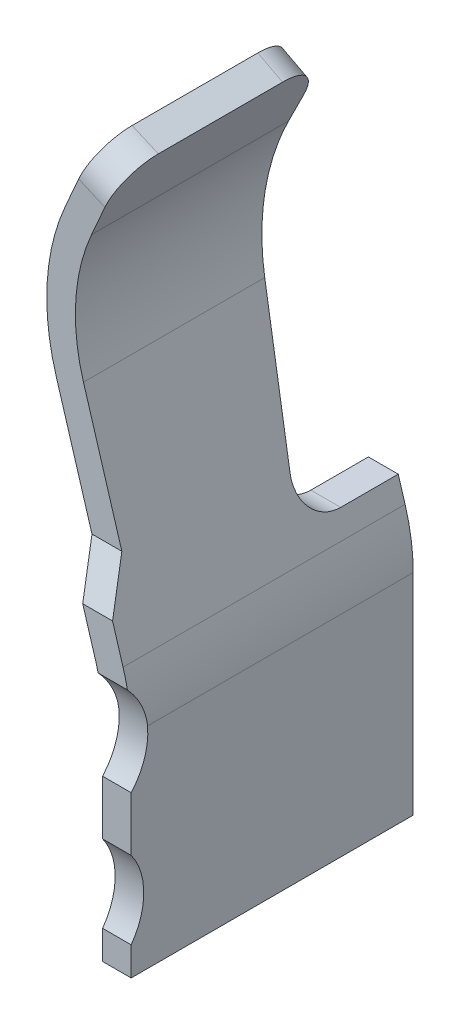
ISO-10303-21;
HEADER;
FILE_DESCRIPTION(('STEP AP214'),'2;1');
FILE_NAME('part.step','',(''),(''),'','','');
FILE_SCHEMA(('AUTOMOTIVE_DESIGN { 1 0 10303 214 1 1 1 1 }'));
ENDSEC;
DATA;
#1=APPLICATION_CONTEXT('core data for automotive mechanical design processes');
#2=APPLICATION_PROTOCOL_DEFINITION('international standard','automotive_design',2000,#1);
#3=PRODUCT_CONTEXT('',#1,'mechanical');
#4=PRODUCT('Part','Part','',(#3));
#5=PRODUCT_RELATED_PRODUCT_CATEGORY('part','',(#4));
#6=PRODUCT_DEFINITION_FORMATION('','',#4);
#7=PRODUCT_DEFINITION_CONTEXT('part definition',#1,'design');
#8=PRODUCT_DEFINITION('design','',#6,#7);
#9=PRODUCT_DEFINITION_SHAPE('','',#8);
#10=(LENGTH_UNIT() NAMED_UNIT(*) SI_UNIT(.MILLI.,.METRE.));
#11=(NAMED_UNIT(*) PLANE_ANGLE_UNIT() SI_UNIT($,.RADIAN.));
#12=(NAMED_UNIT(*) SI_UNIT($,.STERADIAN.) SOLID_ANGLE_UNIT());
#13=UNCERTAINTY_MEASURE_WITH_UNIT(LENGTH_MEASURE(1.E-05),#10,'distance_accuracy_value','');
#14=(GEOMETRIC_REPRESENTATION_CONTEXT(3) GLOBAL_UNCERTAINTY_ASSIGNED_CONTEXT((#13)) GLOBAL_UNIT_ASSIGNED_CONTEXT((#10,
#11,#12)) REPRESENTATION_CONTEXT('',''));
#15=CARTESIAN_POINT('',(0.,0.,0.));
#16=DIRECTION('',(0.,0.,1.));
#17=DIRECTION('',(1.,0.,0.));
#18=AXIS2_PLACEMENT_3D('',#15,#16,#17);
#19=CARTESIAN_POINT('',(9.49844493318108,3.52330708865174,0.423604352914839));
#20=DIRECTION('',(0.915327071470026,-0.402711251685505,0.));
#21=DIRECTION('',(0.402711251685505,0.915327071470026,0.));
#22=AXIS2_PLACEMENT_3D('',#19,#20,#21);
#23=CYLINDRICAL_SURFACE('',#22,0.2);
#24=CARTESIAN_POINT('',(9.49844493318108,3.52330708865174,0.423604352914839));
#25=DIRECTION('',(-0.915327071470029,0.402711251685498,0.));
#26=DIRECTION('',(0.402711251685498,0.915327071470029,0.));
#27=AXIS2_PLACEMENT_3D('',#24,#25,#26);
#28=CIRCLE('',#27,0.2);
#29=CARTESIAN_POINT('',(9.49844493318108,3.52330708865174,0.623604352914839));
#30=VERTEX_POINT('',#29);
#31=CARTESIAN_POINT('',(9.57898718351818,3.70637250294574,0.423604352914839));
#32=VERTEX_POINT('',#31);
#33=EDGE_CURVE('E308',#30,#32,#28,.T.);
#34=ORIENTED_EDGE('',*,*,#33,.F.);
#35=DIRECTION('',(-0.915327071470027,0.402711251685503,0.));
#36=VECTOR('',#35,1.);
#37=CARTESIAN_POINT('',(-15.1115059297135,14.3508073613119,0.623604352914805));
#38=LINE('',#37,#36);
#39=CARTESIAN_POINT('',(9.63574399390158,3.46290040089891,0.623604352914839));
#40=VERTEX_POINT('',#39);
#41=EDGE_CURVE('E27',#40,#30,#38,.T.);
#42=ORIENTED_EDGE('',*,*,#41,.F.);
#43=CARTESIAN_POINT('',(9.63574399390158,3.46290040089891,0.423604352914839));
#44=DIRECTION('',(0.915327071470029,-0.402711251685498,0.));
#45=DIRECTION('',(-0.402711251685498,-0.915327071470029,0.));
#46=AXIS2_PLACEMENT_3D('',#43,#44,#45);
#47=CIRCLE('',#46,0.2);
#48=CARTESIAN_POINT('',(9.71628624423869,3.64596581519291,0.423604352914839));
#49=VERTEX_POINT('',#48);
#50=EDGE_CURVE('E342',#49,#40,#47,.T.);
#51=ORIENTED_EDGE('',*,*,#50,.F.);
#52=DIRECTION('',(0.915327071470027,-0.402711251685503,0.));
#53=VECTOR('',#52,1.);
#54=CARTESIAN_POINT('',(9.57898718351818,3.70637250294574,0.423604352914839));
#55=LINE('',#54,#53);
#56=EDGE_CURVE('E446',#32,#49,#55,.T.);
#57=ORIENTED_EDGE('',*,*,#56,.F.);
#58=EDGE_LOOP('',(#34,#42,#51,#57));
#59=FACE_BOUND('',#58,.T.);
#60=ADVANCED_FACE('F16',(#59),#23,.T.);
#61=CARTESIAN_POINT('',(9.47613725867001,3.53312166947706,-0.236832722369337));
#62=DIRECTION('',(-0.914255270392897,0.402239697454475,-0.0483789866630451));
#63=DIRECTION('',(-0.402711251685505,-0.915327071470026,0.));
#64=AXIS2_PLACEMENT_3D('',#61,#62,#63);
#65=CYLINDRICAL_SURFACE('',#64,0.2);
#66=CARTESIAN_POINT('',(9.62694053804578,3.44289092405021,-0.427421697659668));
#67=CARTESIAN_POINT('',(9.67801746519237,3.55898426375477,-0.441384710680955));
#68=CARTESIAN_POINT('',(9.71628624423869,3.64596581519291,-0.356133634256614));
#69=CARTESIAN_POINT('',(9.71628624423869,3.64596581519291,-0.228386927890316));
#70=(BOUNDED_CURVE() B_SPLINE_CURVE(3,(#66,#67,#68,#69),.UNSPECIFIED.,.F.,
.F.) B_SPLINE_CURVE_WITH_KNOTS((4,4),(6.17366415670651,7.85398163397443),
.UNSPECIFIED.) CURVE() GEOMETRIC_REPRESENTATION_ITEM() RATIONAL_B_SPLINE_CURVE((1.,
0.778229742533869,0.778229742533869,1.)) REPRESENTATION_ITEM(''));
#71=CARTESIAN_POINT('',(9.62694053804578,3.44289092405021,-0.427421697659668));
#72=VERTEX_POINT('',#71);
#73=CARTESIAN_POINT('',(9.71628624423869,3.64596581519291,-0.228386927890316));
#74=VERTEX_POINT('',#73);
#75=EDGE_CURVE('E338',#72,#74,#70,.T.);
#76=ORIENTED_EDGE('',*,*,#75,.F.);
#77=DIRECTION('',(0.914255270392898,-0.402239697454473,0.0483789866630451));
#78=VECTOR('',#77,1.);
#79=CARTESIAN_POINT('',(-15.711852655037,14.5910558161891,-1.76825633941021));
#80=LINE('',#79,#78);
#81=CARTESIAN_POINT('',(9.48964147732528,3.50329761180303,-0.434687053017796));
#82=VERTEX_POINT('',#81);
#83=EDGE_CURVE('E11',#82,#72,#80,.T.);
#84=ORIENTED_EDGE('',*,*,#83,.F.);
#85=CARTESIAN_POINT('',(9.57898718351818,3.70637250294574,-0.235652283248443));
#86=CARTESIAN_POINT('',(9.57898718351819,3.70637250294574,-0.363398989614741));
#87=CARTESIAN_POINT('',(9.54071840447187,3.6193909515076,-0.448650066039082));
#88=CARTESIAN_POINT('',(9.48964147732528,3.50329761180303,-0.434687053017796));
#89=(BOUNDED_CURVE() B_SPLINE_CURVE(3,(#85,#86,#87,#88),.UNSPECIFIED.,.F.,
.F.) B_SPLINE_CURVE_WITH_KNOTS((4,4),(4.71238898038476,6.39270645765267),
.UNSPECIFIED.) CURVE() GEOMETRIC_REPRESENTATION_ITEM() RATIONAL_B_SPLINE_CURVE((1.,
0.778229742533871,0.778229742533871,1.)) REPRESENTATION_ITEM(''));
#90=CARTESIAN_POINT('',(9.57898718351818,3.70637250294574,-0.235652283248443));
#91=VERTEX_POINT('',#90);
#92=EDGE_CURVE('E381',#91,#82,#89,.T.);
#93=ORIENTED_EDGE('',*,*,#92,.F.);
#94=DIRECTION('',(-0.914255270392898,0.402239697454473,-0.0483789866630451));
#95=VECTOR('',#94,1.);
#96=CARTESIAN_POINT('',(9.55667950900711,3.71618708377106,-0.236832722369337));
#97=LINE('',#96,#95);
#98=EDGE_CURVE('E307',#74,#91,#97,.T.);
#99=ORIENTED_EDGE('',*,*,#98,.F.);
#100=EDGE_LOOP('',(#76,#84,#93,#99));
#101=FACE_BOUND('',#100,.T.);
#102=ADVANCED_FACE('F434',(#101),#65,.T.);
#103=CARTESIAN_POINT('',(-20.57,1.65634067151207,-0.212546111318104));
#104=DIRECTION('',(0.,-1.,0.));
#105=DIRECTION('',(0.,0.,-1.));
#106=AXIS2_PLACEMENT_3D('',#103,#104,#105);
#107=PLANE('',#106);
#108=DIRECTION('',(0.,0.,-1.));
#109=VECTOR('',#108,1.);
#110=CARTESIAN_POINT('',(9.65483507894154,1.65634067151207,-0.740000000000018));
#111=LINE('',#110,#109);
#112=CARTESIAN_POINT('',(9.65483507894154,1.65634067151207,-0.438042305987952));
#113=VERTEX_POINT('',#112);
#114=CARTESIAN_POINT('',(9.65483507894154,1.65634067151207,-0.740000000000018));
#115=VERTEX_POINT('',#114);
#116=EDGE_CURVE('E260',#113,#115,#111,.T.);
#117=ORIENTED_EDGE('',*,*,#116,.F.);
#118=DIRECTION('',(1.,0.,0.));
#119=VECTOR('',#118,1.);
#120=CARTESIAN_POINT('',(9.81150340910556,1.65634067151207,-0.438042305987951));
#121=LINE('',#120,#119);
#122=CARTESIAN_POINT('',(9.81150340910558,1.65634067151207,-0.438042305987951));
#123=VERTEX_POINT('',#122);
#124=EDGE_CURVE('E278',#113,#123,#121,.T.);
#125=ORIENTED_EDGE('',*,*,#124,.T.);
#126=DIRECTION('',(0.,0.,1.));
#127=VECTOR('',#126,1.);
#128=CARTESIAN_POINT('',(9.81150340910558,1.65634067151207,-0.740000000000018));
#129=LINE('',#128,#127);
#130=CARTESIAN_POINT('',(9.81150340910558,1.65634067151207,-0.740000000000018));
#131=VERTEX_POINT('',#130);
#132=EDGE_CURVE('E267',#131,#123,#129,.T.);
#133=ORIENTED_EDGE('',*,*,#132,.F.);
#134=DIRECTION('',(-1.,0.,0.));
#135=VECTOR('',#134,1.);
#136=CARTESIAN_POINT('',(8.89,1.65634067151207,-0.740000000000019));
#137=LINE('',#136,#135);
#138=EDGE_CURVE('E517',#131,#115,#137,.T.);
#139=ORIENTED_EDGE('',*,*,#138,.T.);
#140=EDGE_LOOP('',(#117,#125,#133,#139));
#141=FACE_BOUND('',#140,.T.);
#142=ADVANCED_FACE('F279',(#141),#107,.F.);
#143=CARTESIAN_POINT('',(-20.57,3.70637250294571,-0.459111687165995));
#144=DIRECTION('',(0.,0.119413416546905,0.992844618230162));
#145=DIRECTION('',(1.,0.,0.));
#146=AXIS2_PLACEMENT_3D('',#143,#144,#145);
#147=PLANE('',#146);
#148=DIRECTION('',(-0.28674853992682,0.951150986717314,-0.11439875574724));
#149=VECTOR('',#148,1.);
#150=CARTESIAN_POINT('',(9.8296639548885,1.59610175610151,-0.205300934614502));
#151=LINE('',#150,#149);
#152=CARTESIAN_POINT('',(9.74400830743363,1.88022335482146,-0.239473382341919));
#153=VERTEX_POINT('',#152);
#154=CARTESIAN_POINT('',(9.52341373590366,2.61194022573825,-0.327479914176621));
#155=VERTEX_POINT('',#154);
#156=EDGE_CURVE('E178',#153,#155,#151,.T.);
#157=ORIENTED_EDGE('',*,*,#156,.F.);
#158=DIRECTION('',(-1.,0.,0.));
#159=VECTOR('',#158,1.);
#160=CARTESIAN_POINT('',(9.65483507894153,1.88022335482146,-0.23947338234192));
#161=LINE('',#160,#159);
#162=CARTESIAN_POINT('',(9.58733997726959,1.88022335482146,-0.23947338234192));
#163=VERTEX_POINT('',#162);
#164=EDGE_CURVE('E488',#153,#163,#161,.T.);
#165=ORIENTED_EDGE('',*,*,#164,.T.);
#166=DIRECTION('',(0.286748539926818,-0.951150986717315,0.11439875574724));
#167=VECTOR('',#166,1.);
#168=CARTESIAN_POINT('',(9.68587763511194,1.55337185451571,-0.200161637444145));
#169=LINE('',#168,#167);
#170=CARTESIAN_POINT('',(9.37979823954622,2.56864369924933,-0.322272466749579));
#171=VERTEX_POINT('',#170);
#172=EDGE_CURVE('E326',#171,#163,#169,.T.);
#173=ORIENTED_EDGE('',*,*,#172,.F.);
#174=CARTESIAN_POINT('',(9.42822424609609,3.36370167510267,-0.417897288102545));
#175=CARTESIAN_POINT('',(9.31669920509328,3.11021511680704,-0.387409439934768));
#176=CARTESIAN_POINT('',(9.29986260540396,2.83379189253285,-0.354162906673266));
#177=CARTESIAN_POINT('',(9.37979823954622,2.56864369924933,-0.322272466749579));
#178=(BOUNDED_CURVE() B_SPLINE_CURVE(3,(#174,#175,#176,#177),.UNSPECIFIED.,.F.,
.F.) B_SPLINE_CURVE_WITH_KNOTS((4,4),(4.29791199977039,5.00519872138853),
.UNSPECIFIED.) CURVE() GEOMETRIC_REPRESENTATION_ITEM() RATIONAL_B_SPLINE_CURVE((1.,
0.958744787021091,0.958744787021091,1.)) REPRESENTATION_ITEM(''));
#179=CARTESIAN_POINT('',(9.42822424609609,3.36370167510267,-0.417897288102545));
#180=VERTEX_POINT('',#179);
#181=EDGE_CURVE('E472',#180,#171,#178,.T.);
#182=ORIENTED_EDGE('',*,*,#181,.F.);
#183=DIRECTION('',(-0.400292818236851,-0.909830186054405,0.109428936813832));
#184=VECTOR('',#183,1.);
#185=CARTESIAN_POINT('',(9.44233351008822,3.39577078475993,-0.421754368938234));
#186=LINE('',#185,#184);
#187=EDGE_CURVE('E457',#82,#180,#186,.T.);
#188=ORIENTED_EDGE('',*,*,#187,.F.);
#189=ORIENTED_EDGE('',*,*,#83,.T.);
#190=DIRECTION('',(0.400292818236852,0.909830186054405,-0.109428936813832));
#191=VECTOR('',#190,1.);
#192=CARTESIAN_POINT('',(9.57995081965593,3.33608744850051,-0.414576013974332));
#193=LINE('',#192,#191);
#194=CARTESIAN_POINT('',(9.56552330681658,3.30329498734983,-0.410631932744417));
#195=VERTEX_POINT('',#194);
#196=EDGE_CURVE('E343',#195,#72,#193,.T.);
#197=ORIENTED_EDGE('',*,*,#196,.F.);
#198=CARTESIAN_POINT('',(9.52341373590366,2.61194022573825,-0.327479914176621));
#199=CARTESIAN_POINT('',(9.45390448882343,2.84250387207174,-0.355210731501565));
#200=CARTESIAN_POINT('',(9.4685450102924,3.08287189317973,-0.384120760424611));
#201=CARTESIAN_POINT('',(9.56552330681658,3.30329498734983,-0.410631932744417));
#202=(BOUNDED_CURVE() B_SPLINE_CURVE(3,(#198,#199,#200,#201),.UNSPECIFIED.,.F.,
.F.) B_SPLINE_CURVE_WITH_KNOTS((4,4),(1.27798658579106,1.98527330740919),
.UNSPECIFIED.) CURVE() GEOMETRIC_REPRESENTATION_ITEM() RATIONAL_B_SPLINE_CURVE((1.,
0.958744787021091,0.958744787021091,1.)) REPRESENTATION_ITEM(''));
#203=EDGE_CURVE('E358',#155,#195,#202,.T.);
#204=ORIENTED_EDGE('',*,*,#203,.F.);
#205=EDGE_LOOP('',(#157,#165,#173,#182,#188,#189,#197,#204));
#206=FACE_BOUND('',#205,.T.);
#207=ADVANCED_FACE('F594',(#206),#147,.F.);
#208=CARTESIAN_POINT('',(-20.57,1.94413292378283,0.623604352914797));
#209=DIRECTION('',(0.,0.,-1.));
#210=DIRECTION('',(0.,-1.,0.));
#211=AXIS2_PLACEMENT_3D('',#208,#209,#210);
#212=PLANE('',#211);
#213=DIRECTION('',(-0.402711251685501,-0.915327071470028,0.));
#214=VECTOR('',#213,1.);
#215=CARTESIAN_POINT('',(9.56552330681658,3.30329498734984,0.623604352914839));
#216=LINE('',#215,#214);
#217=CARTESIAN_POINT('',(9.56552330681658,3.30329498734984,0.623604352914839));
#218=VERTEX_POINT('',#217);
#219=EDGE_CURVE('E383',#40,#218,#216,.T.);
#220=ORIENTED_EDGE('',*,*,#219,.F.);
#221=ORIENTED_EDGE('',*,*,#41,.T.);
#222=DIRECTION('',(0.4027112516855,0.915327071470028,0.));
#223=VECTOR('',#222,1.);
#224=CARTESIAN_POINT('',(9.42822424609608,3.36370167510267,0.623604352914839));
#225=LINE('',#224,#223);
#226=CARTESIAN_POINT('',(9.42822424609608,3.36370167510267,0.623604352914839));
#227=VERTEX_POINT('',#226);
#228=EDGE_CURVE('E450',#227,#30,#225,.T.);
#229=ORIENTED_EDGE('',*,*,#228,.F.);
#230=CARTESIAN_POINT('',(10.4808503782866,2.90058373566433,0.62360435291484));
#231=DIRECTION('',(0.,0.,-1.));
#232=DIRECTION('',(-1.,0.,0.));
#233=AXIS2_PLACEMENT_3D('',#230,#231,#232);
#234=CIRCLE('',#233,1.15);
#235=CARTESIAN_POINT('',(9.37979823954621,2.56864369924933,0.623604352914839));
#236=VERTEX_POINT('',#235);
#237=EDGE_CURVE('E382',#236,#227,#234,.T.);
#238=ORIENTED_EDGE('',*,*,#237,.F.);
#239=DIRECTION('',(-0.288643509926088,0.957436642382956,0.));
#240=VECTOR('',#239,1.);
#241=CARTESIAN_POINT('',(9.70382114602551,1.49385284836845,0.623604352914839));
#242=LINE('',#241,#240);
#243=CARTESIAN_POINT('',(9.56807282006432,1.94413292378283,0.623604352914839));
#244=VERTEX_POINT('',#243);
#245=EDGE_CURVE('E337',#244,#236,#242,.T.);
#246=ORIENTED_EDGE('',*,*,#245,.F.);
#247=DIRECTION('',(1.,0.,0.));
#248=VECTOR('',#247,1.);
#249=CARTESIAN_POINT('',(-20.57,1.94413292378283,0.623604352914797));
#250=LINE('',#249,#248);
#251=CARTESIAN_POINT('',(9.72474115022836,1.94413292378283,0.623604352914839));
#252=VERTEX_POINT('',#251);
#253=EDGE_CURVE('E520',#244,#252,#250,.T.);
#254=ORIENTED_EDGE('',*,*,#253,.T.);
#255=DIRECTION('',(0.28864350992609,-0.957436642382956,0.));
#256=VECTOR('',#255,1.);
#257=CARTESIAN_POINT('',(9.84743664238296,1.53714937485737,0.623604352914839));
#258=LINE('',#257,#256);
#259=CARTESIAN_POINT('',(9.52341373590366,2.61194022573825,0.623604352914839));
#260=VERTEX_POINT('',#259);
#261=EDGE_CURVE('E480',#260,#252,#258,.T.);
#262=ORIENTED_EDGE('',*,*,#261,.F.);
#263=CARTESIAN_POINT('',(10.4808503782866,2.90058373566433,0.62360435291484));
#264=DIRECTION('',(0.,0.,1.));
#265=DIRECTION('',(-1.,0.,0.));
#266=AXIS2_PLACEMENT_3D('',#263,#264,#265);
#267=CIRCLE('',#266,1.);
#268=EDGE_CURVE('E193',#218,#260,#267,.T.);
#269=ORIENTED_EDGE('',*,*,#268,.F.);
#270=EDGE_LOOP('',(#220,#221,#229,#238,#246,#254,#262,#269));
#271=FACE_BOUND('',#270,.T.);
#272=ADVANCED_FACE('F580',(#271),#212,.F.);
#273=CARTESIAN_POINT('',(-20.57,1.7003498353216,0.749999999999972));
#274=DIRECTION('',(0.,-0.460287319631494,-0.887770005906065));
#275=DIRECTION('',(0.,-0.887770005906065,0.460287319631494));
#276=AXIS2_PLACEMENT_3D('',#273,#274,#275);
#277=PLANE('',#276);
#278=DIRECTION('',(-1.,0.,0.));
#279=VECTOR('',#278,1.);
#280=CARTESIAN_POINT('',(8.89,1.7196371362757,0.739999999999981));
#281=LINE('',#280,#279);
#282=CARTESIAN_POINT('',(9.79242108767926,1.7196371362757,0.739999999999982));
#283=VERTEX_POINT('',#282);
#284=CARTESIAN_POINT('',(9.63575275751522,1.7196371362757,0.739999999999982));
#285=VERTEX_POINT('',#284);
#286=EDGE_CURVE('E299',#283,#285,#281,.T.);
#287=ORIENTED_EDGE('',*,*,#286,.F.);
#288=DIRECTION('',(0.258541028225372,-0.857586072334425,0.444637678635293));
#289=VECTOR('',#288,1.);
#290=CARTESIAN_POINT('',(9.66642343830643,2.13757401070795,0.523309818502748));
#291=LINE('',#290,#289);
#292=EDGE_CURVE('E484',#252,#283,#291,.T.);
#293=ORIENTED_EDGE('',*,*,#292,.F.);
#294=ORIENTED_EDGE('',*,*,#253,.F.);
#295=DIRECTION('',(-0.258541028225371,0.857586072334425,-0.444637678635293));
#296=VECTOR('',#295,1.);
#297=CARTESIAN_POINT('',(9.5202273619162,2.10283732290249,0.541319952677684));
#298=LINE('',#297,#296);
#299=EDGE_CURVE('E317',#285,#244,#298,.T.);
#300=ORIENTED_EDGE('',*,*,#299,.F.);
#301=EDGE_LOOP('',(#287,#293,#294,#300));
#302=FACE_BOUND('',#301,.T.);
#303=ADVANCED_FACE('F422',(#302),#277,.F.);
#304=CARTESIAN_POINT('',(8.89,1.24850586493128,0.739999999999981));
#305=DIRECTION('',(0.,0.,-1.));
#306=DIRECTION('',(0.,-1.,0.));
#307=AXIS2_PLACEMENT_3D('',#304,#305,#306);
#308=PLANE('',#307);
#309=DIRECTION('',(0.,-1.,0.));
#310=VECTOR('',#309,1.);
#311=CARTESIAN_POINT('',(9.89,0.145965815192914,0.739999999999982));
#312=LINE('',#311,#310);
#313=CARTESIAN_POINT('',(9.89,0.296740599868486,0.739999999999982));
#314=VERTEX_POINT('',#313);
#315=CARTESIAN_POINT('',(9.89,0.145965815192914,0.739999999999982));
#316=VERTEX_POINT('',#315);
#317=EDGE_CURVE('E503',#314,#316,#312,.T.);
#318=ORIENTED_EDGE('',*,*,#317,.F.);
#319=DIRECTION('',(-1.,0.,0.));
#320=VECTOR('',#319,1.);
#321=CARTESIAN_POINT('',(-20.57,0.296740599868486,0.73999999999994));
#322=LINE('',#321,#320);
#323=CARTESIAN_POINT('',(9.74,0.296740599868486,0.739999999999982));
#324=VERTEX_POINT('',#323);
#325=EDGE_CURVE('E529',#314,#324,#322,.T.);
#326=ORIENTED_EDGE('',*,*,#325,.T.);
#327=DIRECTION('',(0.,1.,0.));
#328=VECTOR('',#327,1.);
#329=CARTESIAN_POINT('',(9.74,0.145965815192914,0.739999999999982));
#330=LINE('',#329,#328);
#331=CARTESIAN_POINT('',(9.74,0.145965815192914,0.739999999999982));
#332=VERTEX_POINT('',#331);
#333=EDGE_CURVE('E117',#332,#324,#330,.T.);
#334=ORIENTED_EDGE('',*,*,#333,.F.);
#335=DIRECTION('',(-1.,0.,0.));
#336=VECTOR('',#335,1.);
#337=CARTESIAN_POINT('',(9.74,0.145965815192914,0.739999999999982));
#338=LINE('',#337,#336);
#339=EDGE_CURVE('E395',#316,#332,#338,.T.);
#340=ORIENTED_EDGE('',*,*,#339,.F.);
#341=EDGE_LOOP('',(#318,#326,#334,#340));
#342=FACE_BOUND('',#341,.T.);
#343=ADVANCED_FACE('F552',(#342),#308,.F.);
#344=CARTESIAN_POINT('',(8.89,1.24850586493128,-0.740000000000019));
#345=DIRECTION('',(0.,0.,-1.));
#346=DIRECTION('',(0.,-1.,0.));
#347=AXIS2_PLACEMENT_3D('',#344,#345,#346);
#348=PLANE('',#347);
#349=ORIENTED_EDGE('',*,*,#138,.F.);
#350=DIRECTION('',(0.28864350992609,-0.957436642382956,0.));
#351=VECTOR('',#350,1.);
#352=CARTESIAN_POINT('',(9.84743664238296,1.53714937485737,-0.740000000000018));
#353=LINE('',#352,#351);
#354=CARTESIAN_POINT('',(9.84743664238296,1.53714937485737,-0.740000000000018));
#355=VERTEX_POINT('',#354);
#356=EDGE_CURVE('E274',#131,#355,#353,.T.);
#357=ORIENTED_EDGE('',*,*,#356,.T.);
#358=CARTESIAN_POINT('',(8.89,1.24850586493128,-0.740000000000019));
#359=DIRECTION('',(0.,0.,-1.));
#360=DIRECTION('',(-1.,0.,0.));
#361=AXIS2_PLACEMENT_3D('',#358,#359,#360);
#362=CIRCLE('',#361,1.);
#363=CARTESIAN_POINT('',(9.89,1.24850586493128,-0.740000000000018));
#364=VERTEX_POINT('',#363);
#365=EDGE_CURVE('E500',#355,#364,#362,.T.);
#366=ORIENTED_EDGE('',*,*,#365,.T.);
#367=DIRECTION('',(0.,-1.,0.));
#368=VECTOR('',#367,1.);
#369=CARTESIAN_POINT('',(9.89,0.145965815192914,-0.740000000000018));
#370=LINE('',#369,#368);
#371=CARTESIAN_POINT('',(9.89,0.145965815192914,-0.740000000000018));
#372=VERTEX_POINT('',#371);
#373=EDGE_CURVE('E42',#364,#372,#370,.T.);
#374=ORIENTED_EDGE('',*,*,#373,.T.);
#375=DIRECTION('',(-1.,0.,0.));
#376=VECTOR('',#375,1.);
#377=CARTESIAN_POINT('',(9.74,0.145965815192914,-0.740000000000018));
#378=LINE('',#377,#376);
#379=CARTESIAN_POINT('',(9.74,0.145965815192914,-0.740000000000018));
#380=VERTEX_POINT('',#379);
#381=EDGE_CURVE('E372',#372,#380,#378,.T.);
#382=ORIENTED_EDGE('',*,*,#381,.T.);
#383=DIRECTION('',(0.,1.,0.));
#384=VECTOR('',#383,1.);
#385=CARTESIAN_POINT('',(9.74,0.145965815192914,-0.740000000000018));
#386=LINE('',#385,#384);
#387=CARTESIAN_POINT('',(9.74,1.24850586493128,-0.740000000000018));
#388=VERTEX_POINT('',#387);
#389=EDGE_CURVE('E467',#380,#388,#386,.T.);
#390=ORIENTED_EDGE('',*,*,#389,.T.);
#391=CARTESIAN_POINT('',(8.89,1.24850586493128,-0.740000000000019));
#392=DIRECTION('',(0.,0.,1.));
#393=DIRECTION('',(-1.,0.,0.));
#394=AXIS2_PLACEMENT_3D('',#391,#392,#393);
#395=CIRCLE('',#394,0.85);
#396=CARTESIAN_POINT('',(9.70382114602551,1.49385284836845,-0.740000000000018));
#397=VERTEX_POINT('',#396);
#398=EDGE_CURVE('E348',#388,#397,#395,.T.);
#399=ORIENTED_EDGE('',*,*,#398,.T.);
#400=DIRECTION('',(-0.288643509926088,0.957436642382956,0.));
#401=VECTOR('',#400,1.);
#402=CARTESIAN_POINT('',(9.70382114602551,1.49385284836845,-0.740000000000018));
#403=LINE('',#402,#401);
#404=EDGE_CURVE('E314',#397,#115,#403,.T.);
#405=ORIENTED_EDGE('',*,*,#404,.T.);
#406=EDGE_LOOP('',(#349,#357,#366,#374,#382,#390,#399,#405));
#407=FACE_BOUND('',#406,.T.);
#408=ADVANCED_FACE('F428',(#407),#348,.T.);
#409=CARTESIAN_POINT('',(9.89,0.145965815192914,-0.740000000000018));
#410=DIRECTION('',(-1.,0.,0.));
#411=DIRECTION('',(0.,0.,1.));
#412=AXIS2_PLACEMENT_3D('',#409,#410,#411);
#413=PLANE('',#412);
#414=DIRECTION('',(0.,0.,1.));
#415=VECTOR('',#414,1.);
#416=CARTESIAN_POINT('',(9.89,1.24850586493128,-0.740000000000018));
#417=LINE('',#416,#415);
#418=CARTESIAN_POINT('',(9.89,1.24850586493128,0.654029100989327));
#419=VERTEX_POINT('',#418);
#420=EDGE_CURVE('E499',#364,#419,#417,.T.);
#421=ORIENTED_EDGE('',*,*,#420,.T.);
#422=CARTESIAN_POINT('',(9.89,1.21669179396546,0.995153761033099));
#423=DIRECTION('',(1.,0.,0.));
#424=DIRECTION('',(0.,0.,1.));
#425=AXIS2_PLACEMENT_3D('',#422,#423,#424);
#426=CIRCLE('',#425,0.342604974863759);
#427=CARTESIAN_POINT('',(9.89,0.988055123608201,0.739999999999982));
#428=VERTEX_POINT('',#427);
#429=EDGE_CURVE('E478',#428,#419,#426,.T.);
#430=ORIENTED_EDGE('',*,*,#429,.F.);
#431=DIRECTION('',(0.,-1.,0.));
#432=VECTOR('',#431,1.);
#433=CARTESIAN_POINT('',(9.89,0.145965815192914,0.739999999999982));
#434=LINE('',#433,#432);
#435=CARTESIAN_POINT('',(9.89,0.703259400131467,0.739999999999982));
#436=VERTEX_POINT('',#435);
#437=EDGE_CURVE('E390',#428,#436,#434,.T.);
#438=ORIENTED_EDGE('',*,*,#437,.T.);
#439=CARTESIAN_POINT('',(9.89,0.499999999999977,1.01942683457021));
#440=DIRECTION('',(1.,0.,0.));
#441=DIRECTION('',(0.,0.,1.));
#442=AXIS2_PLACEMENT_3D('',#439,#440,#441);
#443=CIRCLE('',#442,0.345533991988848);
#444=EDGE_CURVE('E532',#314,#436,#443,.T.);
#445=ORIENTED_EDGE('',*,*,#444,.F.);
#446=ORIENTED_EDGE('',*,*,#317,.T.);
#447=DIRECTION('',(0.,0.,1.));
#448=VECTOR('',#447,1.);
#449=CARTESIAN_POINT('',(9.89,0.145965815192914,-0.740000000000018));
#450=LINE('',#449,#448);
#451=EDGE_CURVE('E364',#372,#316,#450,.T.);
#452=ORIENTED_EDGE('',*,*,#451,.F.);
#453=ORIENTED_EDGE('',*,*,#373,.F.);
#454=EDGE_LOOP('',(#421,#430,#438,#445,#446,#452,#453));
#455=FACE_BOUND('',#454,.T.);
#456=ADVANCED_FACE('F424',(#455),#413,.F.);
#457=CARTESIAN_POINT('',(8.89,1.24850586493128,-0.740000000000019));
#458=DIRECTION('',(0.,0.,1.));
#459=DIRECTION('',(1.,0.,0.));
#460=AXIS2_PLACEMENT_3D('',#457,#458,#459);
#461=CYLINDRICAL_SURFACE('',#460,1.);
#462=CARTESIAN_POINT('',(8.89,1.24850586493128,0.739999999999981));
#463=DIRECTION('',(0.,0.,-1.));
#464=DIRECTION('',(-1.,0.,0.));
#465=AXIS2_PLACEMENT_3D('',#462,#463,#464);
#466=CIRCLE('',#465,1.);
#467=CARTESIAN_POINT('',(9.84743664238295,1.53714937485737,0.739999999999982));
#468=VERTEX_POINT('',#467);
#469=CARTESIAN_POINT('',(9.87043911813473,1.44532846432271,0.739999999999982));
#470=VERTEX_POINT('',#469);
#471=EDGE_CURVE('E394',#468,#470,#466,.T.);
#472=ORIENTED_EDGE('',*,*,#471,.T.);
#473=CARTESIAN_POINT('',(9.87043911813472,1.44532846432271,0.739999999999982));
#474=CARTESIAN_POINT('',(9.87112131741684,1.44193024717419,0.736954698545516));
#475=CARTESIAN_POINT('',(9.8717972185085,1.43847176034268,0.733975045899713));
#476=CARTESIAN_POINT('',(9.87312855952598,1.43145643098167,0.728168909339949));
#477=CARTESIAN_POINT('',(9.87378408931623,1.42790021102164,0.725341693611874));
#478=CARTESIAN_POINT('',(9.87507168816973,1.42068928784956,0.719840380711192));
#479=CARTESIAN_POINT('',(9.87570383827923,1.4170350195159,0.71716573280554));
#480=CARTESIAN_POINT('',(9.87694157212658,1.40962817005619,0.711969336935339));
#481=CARTESIAN_POINT('',(9.87754721552129,1.4058758436612,0.709447240161798));
#482=CARTESIAN_POINT('',(9.87872877129686,1.39827302810706,0.704555749407337));
#483=CARTESIAN_POINT('',(9.87930470888847,1.39442262647134,0.702186225501929));
#484=CARTESIAN_POINT('',(9.88042361722598,1.38662388081506,0.697599649617342));
#485=CARTESIAN_POINT('',(9.88096656581679,1.38267547342761,0.695382699975815));
#486=CARTESIAN_POINT('',(9.88201619604995,1.37468096295901,0.69110105992819));
#487=CARTESIAN_POINT('',(9.88252279573886,1.37063466501774,0.689036713287309));
#488=CARTESIAN_POINT('',(9.88349635159398,1.36244473872738,0.685059955148913));
#489=CARTESIAN_POINT('',(9.88396315439605,1.3583008060415,0.683148133100318));
#490=CARTESIAN_POINT('',(9.88485385101726,1.3499144264909,0.679475891500462));
#491=CARTESIAN_POINT('',(9.88527749507101,1.3456715635433,0.677716361222172));
#492=CARTESIAN_POINT('',(9.88607352805793,1.33713872195227,0.674376033868785));
#493=CARTESIAN_POINT('',(9.88644618935102,1.33284913740284,0.672794295796538));
#494=CARTESIAN_POINT('',(9.88713863854791,1.32422362544503,0.669809238507263));
#495=CARTESIAN_POINT('',(9.88745863414993,1.31988795555442,0.668405223722634));
#496=CARTESIAN_POINT('',(9.88804414411011,1.31117101253269,0.665775382478372));
#497=CARTESIAN_POINT('',(9.88830979142467,1.30678987892403,0.664549123358656));
#498=CARTESIAN_POINT('',(9.88878499367845,1.29798278695419,0.662274523841787));
#499=CARTESIAN_POINT('',(9.88899459796072,1.29355687160866,0.661226027233393));
#500=CARTESIAN_POINT('',(9.88935611224076,1.28466100981392,0.659306657193421));
#501=CARTESIAN_POINT('',(9.88950798054882,1.28019103392999,0.658435912321225));
#502=CARTESIAN_POINT('',(9.88975239151872,1.2712078703344,0.656871822149796));
#503=CARTESIAN_POINT('',(9.88984479570128,1.26669460642063,0.65617889318397));
#504=CARTESIAN_POINT('',(9.88996875637607,1.25762568522585,0.654969909316693));
#505=CARTESIAN_POINT('',(9.89000007412201,1.25306993125338,0.654454554866673));
#506=CARTESIAN_POINT('',(9.89,1.24850586493128,0.654029100989326));
#507=B_SPLINE_CURVE_WITH_KNOTS('',3,(#473,#474,#475,#476,#477,#478,#479,#480,#481,#482,#483,
#484,#485,#486,#487,#488,#489,#490,#491,#492,#493,#494,#495,#496,#497,#498,#499,#500,#501,#502,
#503,#504,#505,#506),.UNSPECIFIED.,.F.,.F.,(4,2,2,2,2,2,2,2,2,2,2,2,2,2,2,2,4),(0.,
0.0138407212061407,0.0276076629969691,0.0413212735159895,0.0550022400252169,0.0686713979829165,
0.082349636791924,0.096057804322891,0.1098166123811,0.123650992269016,0.137408310969681,
0.151110002599511,0.164777762982779,0.178433449670275,0.192098978145428,0.205796216649482,
0.219546882133365),.UNSPECIFIED.);
#508=EDGE_CURVE('E653',#470,#419,#507,.T.);
#509=ORIENTED_EDGE('',*,*,#508,.T.);
#510=ORIENTED_EDGE('',*,*,#420,.F.);
#511=ORIENTED_EDGE('',*,*,#365,.F.);
#512=DIRECTION('',(0.,0.,1.));
#513=VECTOR('',#512,1.);
#514=CARTESIAN_POINT('',(9.84743664238296,1.53714937485737,-0.740000000000018));
#515=LINE('',#514,#513);
#516=EDGE_CURVE('E495',#355,#468,#515,.T.);
#517=ORIENTED_EDGE('',*,*,#516,.T.);
#518=EDGE_LOOP('',(#472,#509,#510,#511,#517));
#519=FACE_BOUND('',#518,.T.);
#520=ADVANCED_FACE('F427',(#519),#461,.T.);
#521=CARTESIAN_POINT('',(9.84743664238296,1.53714937485737,-0.740000000000018));
#522=DIRECTION('',(-0.957436642382956,-0.28864350992609,0.));
#523=DIRECTION('',(-0.28864350992609,0.957436642382956,0.));
#524=AXIS2_PLACEMENT_3D('',#521,#522,#523);
#525=PLANE('',#524);
#526=ORIENTED_EDGE('',*,*,#356,.F.);
#527=ORIENTED_EDGE('',*,*,#132,.T.);
#528=CARTESIAN_POINT('',(9.81150340910558,1.65634067151207,-0.438042305987951));
#529=CARTESIAN_POINT('',(9.81150340910557,1.65634067151208,-0.320885018462571));
#530=CARTESIAN_POINT('',(9.78652837656353,1.73918338398669,-0.238042305987951));
#531=CARTESIAN_POINT('',(9.75120834682184,1.85634067151208,-0.238042305987952));
#532=(BOUNDED_CURVE() B_SPLINE_CURVE(3,(#528,#529,#530,#531),.UNSPECIFIED.,.F.,
.F.) B_SPLINE_CURVE_WITH_KNOTS((4,4),(3.1415926535898,4.71238898038469),
.UNSPECIFIED.) CURVE() GEOMETRIC_REPRESENTATION_ITEM() RATIONAL_B_SPLINE_CURVE((1.,
0.804737854124365,0.804737854124365,1.)) REPRESENTATION_ITEM(''));
#533=CARTESIAN_POINT('',(9.75120834682184,1.85634067151208,-0.238042305987952));
#534=VERTEX_POINT('',#533);
#535=EDGE_CURVE('E270',#123,#534,#532,.T.);
#536=ORIENTED_EDGE('',*,*,#535,.T.);
#537=CARTESIAN_POINT('',(9.75120834682184,1.85634067151208,-0.238042305987952));
#538=CARTESIAN_POINT('',(9.74880115558452,1.86432537588468,-0.238042305987952));
#539=CARTESIAN_POINT('',(9.74639827429865,1.87229578405696,-0.23851990151267));
#540=CARTESIAN_POINT('',(9.74400830743363,1.88022335482146,-0.239473382341919));
#541=(BOUNDED_CURVE() B_SPLINE_CURVE(3,(#537,#538,#539,#540),.UNSPECIFIED.,.F.,
.F.) B_SPLINE_CURVE_WITH_KNOTS((4,4),(4.71238898038469,4.83208803082147),
.UNSPECIFIED.) CURVE() GEOMETRIC_REPRESENTATION_ITEM() RATIONAL_B_SPLINE_CURVE((1.,
0.998806367803328,0.998806367803328,1.)) REPRESENTATION_ITEM(''));
#542=EDGE_CURVE('E286',#534,#153,#541,.T.);
#543=ORIENTED_EDGE('',*,*,#542,.T.);
#544=ORIENTED_EDGE('',*,*,#156,.T.);
#545=DIRECTION('',(0.,0.,1.));
#546=VECTOR('',#545,1.);
#547=CARTESIAN_POINT('',(9.52341373590366,2.61194022573825,-0.740000000000018));
#548=LINE('',#547,#546);
#549=EDGE_CURVE('E363',#155,#260,#548,.T.);
#550=ORIENTED_EDGE('',*,*,#549,.T.);
#551=ORIENTED_EDGE('',*,*,#261,.T.);
#552=ORIENTED_EDGE('',*,*,#292,.T.);
#553=DIRECTION('',(0.28864350992609,-0.957436642382956,0.));
#554=VECTOR('',#553,1.);
#555=CARTESIAN_POINT('',(9.84743664238296,1.53714937485737,0.739999999999982));
#556=LINE('',#555,#554);
#557=EDGE_CURVE('E309',#283,#468,#556,.T.);
#558=ORIENTED_EDGE('',*,*,#557,.T.);
#559=ORIENTED_EDGE('',*,*,#516,.F.);
#560=EDGE_LOOP('',(#526,#527,#536,#543,#544,#550,#551,#552,#558,#559));
#561=FACE_BOUND('',#560,.T.);
#562=ADVANCED_FACE('F268',(#561),#525,.F.);
#563=CARTESIAN_POINT('',(10.4808503782866,2.90058373566433,-0.740000000000017));
#564=DIRECTION('',(0.,0.,1.));
#565=DIRECTION('',(1.,0.,0.));
#566=AXIS2_PLACEMENT_3D('',#563,#564,#565);
#567=CYLINDRICAL_SURFACE('',#566,1.);
#568=ORIENTED_EDGE('',*,*,#549,.F.);
#569=ORIENTED_EDGE('',*,*,#203,.T.);
#570=DIRECTION('',(0.,0.,1.));
#571=VECTOR('',#570,1.);
#572=CARTESIAN_POINT('',(9.56552330681658,3.30329498734983,-0.740000000000018));
#573=LINE('',#572,#571);
#574=EDGE_CURVE('E387',#195,#218,#573,.T.);
#575=ORIENTED_EDGE('',*,*,#574,.T.);
#576=ORIENTED_EDGE('',*,*,#268,.T.);
#577=EDGE_LOOP('',(#568,#569,#575,#576));
#578=FACE_BOUND('',#577,.T.);
#579=ADVANCED_FACE('F429',(#578),#567,.F.);
#580=CARTESIAN_POINT('',(9.56552330681658,3.30329498734984,-0.740000000000018));
#581=DIRECTION('',(-0.915327071470028,0.402711251685501,0.));
#582=DIRECTION('',(0.,0.,1.));
#583=AXIS2_PLACEMENT_3D('',#580,#581,#582);
#584=PLANE('',#583);
#585=ORIENTED_EDGE('',*,*,#196,.T.);
#586=ORIENTED_EDGE('',*,*,#75,.T.);
#587=DIRECTION('',(0.,0.,1.));
#588=VECTOR('',#587,1.);
#589=CARTESIAN_POINT('',(9.71628624423869,3.64596581519291,-0.740000000000018));
#590=LINE('',#589,#588);
#591=EDGE_CURVE('E301',#74,#49,#590,.T.);
#592=ORIENTED_EDGE('',*,*,#591,.T.);
#593=ORIENTED_EDGE('',*,*,#50,.T.);
#594=ORIENTED_EDGE('',*,*,#219,.T.);
#595=ORIENTED_EDGE('',*,*,#574,.F.);
#596=EDGE_LOOP('',(#585,#586,#592,#593,#594,#595));
#597=FACE_BOUND('',#596,.T.);
#598=ADVANCED_FACE('F431',(#597),#584,.F.);
#599=CARTESIAN_POINT('',(9.57898718351818,3.70637250294574,-0.740000000000018));
#600=DIRECTION('',(-0.402711251685503,-0.915327071470027,0.));
#601=DIRECTION('',(-0.915327071470027,0.402711251685503,0.));
#602=AXIS2_PLACEMENT_3D('',#599,#600,#601);
#603=PLANE('',#602);
#604=ORIENTED_EDGE('',*,*,#591,.F.);
#605=ORIENTED_EDGE('',*,*,#98,.T.);
#606=DIRECTION('',(0.,0.,1.));
#607=VECTOR('',#606,1.);
#608=CARTESIAN_POINT('',(9.57898718351818,3.70637250294574,-0.740000000000018));
#609=LINE('',#608,#607);
#610=EDGE_CURVE('E377',#91,#32,#609,.T.);
#611=ORIENTED_EDGE('',*,*,#610,.T.);
#612=ORIENTED_EDGE('',*,*,#56,.T.);
#613=EDGE_LOOP('',(#604,#605,#611,#612));
#614=FACE_BOUND('',#613,.T.);
#615=ADVANCED_FACE('F586',(#614),#603,.F.);
#616=CARTESIAN_POINT('',(9.42822424609609,3.36370167510267,-0.740000000000018));
#617=DIRECTION('',(0.915327071470028,-0.4027112516855,0.));
#618=DIRECTION('',(0.,0.,-1.));
#619=AXIS2_PLACEMENT_3D('',#616,#617,#618);
#620=PLANE('',#619);
#621=ORIENTED_EDGE('',*,*,#610,.F.);
#622=ORIENTED_EDGE('',*,*,#92,.T.);
#623=ORIENTED_EDGE('',*,*,#187,.T.);
#624=DIRECTION('',(0.,0.,1.));
#625=VECTOR('',#624,1.);
#626=CARTESIAN_POINT('',(9.42822424609609,3.36370167510267,-0.740000000000018));
#627=LINE('',#626,#625);
#628=EDGE_CURVE('E357',#180,#227,#627,.T.);
#629=ORIENTED_EDGE('',*,*,#628,.T.);
#630=ORIENTED_EDGE('',*,*,#228,.T.);
#631=ORIENTED_EDGE('',*,*,#33,.T.);
#632=EDGE_LOOP('',(#621,#622,#623,#629,#630,#631));
#633=FACE_BOUND('',#632,.T.);
#634=ADVANCED_FACE('F453',(#633),#620,.F.);
#635=CARTESIAN_POINT('',(10.4808503782866,2.90058373566433,-0.740000000000017));
#636=DIRECTION('',(0.,0.,1.));
#637=DIRECTION('',(1.,0.,0.));
#638=AXIS2_PLACEMENT_3D('',#635,#636,#637);
#639=CYLINDRICAL_SURFACE('',#638,1.15);
#640=ORIENTED_EDGE('',*,*,#628,.F.);
#641=ORIENTED_EDGE('',*,*,#181,.T.);
#642=DIRECTION('',(0.,0.,1.));
#643=VECTOR('',#642,1.);
#644=CARTESIAN_POINT('',(9.37979823954622,2.56864369924933,-0.740000000000019));
#645=LINE('',#644,#643);
#646=EDGE_CURVE('E353',#171,#236,#645,.T.);
#647=ORIENTED_EDGE('',*,*,#646,.T.);
#648=ORIENTED_EDGE('',*,*,#237,.T.);
#649=EDGE_LOOP('',(#640,#641,#647,#648));
#650=FACE_BOUND('',#649,.T.);
#651=ADVANCED_FACE('F601',(#650),#639,.T.);
#652=CARTESIAN_POINT('',(9.70382114602551,1.49385284836845,-0.740000000000018));
#653=DIRECTION('',(0.957436642382956,0.288643509926088,0.));
#654=DIRECTION('',(0.,0.,-1.));
#655=AXIS2_PLACEMENT_3D('',#652,#653,#654);
#656=PLANE('',#655);
#657=ORIENTED_EDGE('',*,*,#172,.T.);
#658=CARTESIAN_POINT('',(9.58733997726959,1.88022335482146,-0.23947338234192));
#659=CARTESIAN_POINT('',(9.58972994413461,1.87229578405696,-0.23851990151267));
#660=CARTESIAN_POINT('',(9.59213282542048,1.86432537588468,-0.238042305987952));
#661=CARTESIAN_POINT('',(9.5945400166578,1.85634067151208,-0.238042305987952));
#662=(BOUNDED_CURVE() B_SPLINE_CURVE(3,(#658,#659,#660,#661),.UNSPECIFIED.,.F.,
.F.) B_SPLINE_CURVE_WITH_KNOTS((4,4),(1.45109727635811,1.5707963267949),
.UNSPECIFIED.) CURVE() GEOMETRIC_REPRESENTATION_ITEM() RATIONAL_B_SPLINE_CURVE((1.,
0.998806367803328,0.998806367803328,1.)) REPRESENTATION_ITEM(''));
#663=CARTESIAN_POINT('',(9.5945400166578,1.85634067151208,-0.238042305987952));
#664=VERTEX_POINT('',#663);
#665=EDGE_CURVE('E251',#163,#664,#662,.T.);
#666=ORIENTED_EDGE('',*,*,#665,.T.);
#667=CARTESIAN_POINT('',(9.5945400166578,1.85634067151208,-0.238042305987952));
#668=CARTESIAN_POINT('',(9.62986004639949,1.73918338398669,-0.238042305987952));
#669=CARTESIAN_POINT('',(9.65483507894154,1.65634067151208,-0.320885018462571));
#670=CARTESIAN_POINT('',(9.65483507894154,1.65634067151207,-0.438042305987952));
#671=(BOUNDED_CURVE() B_SPLINE_CURVE(3,(#667,#668,#669,#670),.UNSPECIFIED.,.F.,
.F.) B_SPLINE_CURVE_WITH_KNOTS((4,4),(1.5707963267949,3.1415926535898),
.UNSPECIFIED.) CURVE() GEOMETRIC_REPRESENTATION_ITEM() RATIONAL_B_SPLINE_CURVE((1.,
0.804737854124365,0.804737854124365,1.)) REPRESENTATION_ITEM(''));
#672=EDGE_CURVE('E282',#664,#113,#671,.T.);
#673=ORIENTED_EDGE('',*,*,#672,.T.);
#674=ORIENTED_EDGE('',*,*,#116,.T.);
#675=ORIENTED_EDGE('',*,*,#404,.F.);
#676=DIRECTION('',(0.,0.,1.));
#677=VECTOR('',#676,1.);
#678=CARTESIAN_POINT('',(9.70382114602551,1.49385284836845,-0.740000000000018));
#679=LINE('',#678,#677);
#680=CARTESIAN_POINT('',(9.70382114602551,1.49385284836845,0.739999999999982));
#681=VERTEX_POINT('',#680);
#682=EDGE_CURVE('E352',#397,#681,#679,.T.);
#683=ORIENTED_EDGE('',*,*,#682,.T.);
#684=DIRECTION('',(-0.288643509926088,0.957436642382956,0.));
#685=VECTOR('',#684,1.);
#686=CARTESIAN_POINT('',(9.70382114602551,1.49385284836845,0.739999999999982));
#687=LINE('',#686,#685);
#688=EDGE_CURVE('E506',#681,#285,#687,.T.);
#689=ORIENTED_EDGE('',*,*,#688,.T.);
#690=ORIENTED_EDGE('',*,*,#299,.T.);
#691=ORIENTED_EDGE('',*,*,#245,.T.);
#692=ORIENTED_EDGE('',*,*,#646,.F.);
#693=EDGE_LOOP('',(#657,#666,#673,#674,#675,#683,#689,#690,#691,#692));
#694=FACE_BOUND('',#693,.T.);
#695=ADVANCED_FACE('F18',(#694),#656,.F.);
#696=CARTESIAN_POINT('',(8.89,1.24850586493128,-0.740000000000019));
#697=DIRECTION('',(0.,0.,1.));
#698=DIRECTION('',(1.,0.,0.));
#699=AXIS2_PLACEMENT_3D('',#696,#697,#698);
#700=CYLINDRICAL_SURFACE('',#699,0.85);
#701=DIRECTION('',(0.,0.,1.));
#702=VECTOR('',#701,1.);
#703=CARTESIAN_POINT('',(9.74,1.24850586493128,-0.740000000000018));
#704=LINE('',#703,#702);
#705=CARTESIAN_POINT('',(9.74,1.24850586493128,0.654029100989327));
#706=VERTEX_POINT('',#705);
#707=EDGE_CURVE('E371',#388,#706,#704,.T.);
#708=ORIENTED_EDGE('',*,*,#707,.T.);
#709=CARTESIAN_POINT('',(9.74,1.24850586493128,0.654029100989326));
#710=CARTESIAN_POINT('',(9.74000008790192,1.25307172693072,0.654454720262653));
#711=CARTESIAN_POINT('',(9.73996321394179,1.2576292439299,0.654970441218037));
#712=CARTESIAN_POINT('',(9.73981723689208,1.26670316475274,0.656180580970977));
#713=CARTESIAN_POINT('',(9.73970838571633,1.27121965647114,0.656874371378064));
#714=CARTESIAN_POINT('',(9.73942040339788,1.28021043459208,0.658440607166923));
#715=CARTESIAN_POINT('',(9.73924140666661,1.28468478505232,0.659312709351964));
#716=CARTESIAN_POINT('',(9.73881520972133,1.2935902670697,0.661235215653709));
#717=CARTESIAN_POINT('',(9.73856803077561,1.29802141165863,0.662285564130272));
#718=CARTESIAN_POINT('',(9.73800750291943,1.30683955789816,0.664564290110336));
#719=CARTESIAN_POINT('',(9.73769406910965,1.3112264952717,0.665792895393389));
#720=CARTESIAN_POINT('',(9.73700306354454,1.3199553830383,0.668427852265608));
#721=CARTESIAN_POINT('',(9.73662530965203,1.32429716745969,0.669834705627405));
#722=CARTESIAN_POINT('',(9.73580767637721,1.33293499859319,0.672825870710048));
#723=CARTESIAN_POINT('',(9.73536752821893,1.33723075608429,0.674410943694417));
#724=CARTESIAN_POINT('',(9.7344271104307,1.34577581205593,0.677758358644044));
#725=CARTESIAN_POINT('',(9.73392649735798,1.35002467970648,0.679521703002883));
#726=CARTESIAN_POINT('',(9.73287530667302,1.35841002700124,0.683196490683988));
#727=CARTESIAN_POINT('',(9.73232516662161,1.36254713822223,0.685106618702997));
#728=CARTESIAN_POINT('',(9.73117755921635,1.37072413591801,0.689079813923348));
#729=CARTESIAN_POINT('',(9.73058024734152,1.37476428891449,0.691142377362335));
#730=CARTESIAN_POINT('',(9.72934234117284,1.38274714659984,0.695420264462287));
#731=CARTESIAN_POINT('',(9.7287018219056,1.38669000475784,0.697635323456368));
#732=CARTESIAN_POINT('',(9.72738143447402,1.39447822720224,0.702217943436393));
#733=CARTESIAN_POINT('',(9.72670157427931,1.3983236110095,0.704585473545778));
#734=CARTESIAN_POINT('',(9.72530633778048,1.40591692940946,0.709472808735993));
#735=CARTESIAN_POINT('',(9.7245909166529,1.40966473145133,0.711992806913636));
#736=CARTESIAN_POINT('',(9.72312828109072,1.41706305442179,0.717184847198785));
#737=CARTESIAN_POINT('',(9.72238098377835,1.42071327585339,0.719857292619193));
#738=CARTESIAN_POINT('',(9.72085822273561,1.42791663066843,0.725354048734686));
#739=CARTESIAN_POINT('',(9.72008265290592,1.43146928614076,0.728178955935566));
#740=CARTESIAN_POINT('',(9.71850682190295,1.43847803402682,0.733980340907034));
#741=CARTESIAN_POINT('',(9.71770644559636,1.44193346413619,0.736957587769727));
#742=CARTESIAN_POINT('',(9.7168983398029,1.44532846432271,0.739999999999982));
#743=B_SPLINE_CURVE_WITH_KNOTS('',3,(#709,#710,#711,#712,#713,#714,#715,#716,#717,#718,#719,
#720,#721,#722,#723,#724,#725,#726,#727,#728,#729,#730,#731,#732,#733,#734,#735,#736,#737,#738,
#739,#740,#741,#742),.UNSPECIFIED.,.F.,.F.,(4,2,2,2,2,2,2,2,2,2,2,2,2,2,2,2,4),(0.,
0.0137560099808466,0.0274641281896842,0.0411461066334218,0.0548238220340017,0.0685191715448322,
0.0822539679805722,0.0960498370493759,0.109928118966908,0.12369398612302,0.137416236293347,
0.151115243354623,0.164811484933649,0.178525451068533,0.192277552593646,0.206088031282691,
0.219976873694124),.UNSPECIFIED.);
#744=CARTESIAN_POINT('',(9.7168983398029,1.44532846432271,0.739999999999982));
#745=VERTEX_POINT('',#744);
#746=EDGE_CURVE('E404',#706,#745,#743,.T.);
#747=ORIENTED_EDGE('',*,*,#746,.T.);
#748=CARTESIAN_POINT('',(8.89,1.24850586493128,0.739999999999981));
#749=DIRECTION('',(0.,0.,1.));
#750=DIRECTION('',(-1.,0.,0.));
#751=AXIS2_PLACEMENT_3D('',#748,#749,#750);
#752=CIRCLE('',#751,0.85);
#753=EDGE_CURVE('E510',#745,#681,#752,.T.);
#754=ORIENTED_EDGE('',*,*,#753,.T.);
#755=ORIENTED_EDGE('',*,*,#682,.F.);
#756=ORIENTED_EDGE('',*,*,#398,.F.);
#757=EDGE_LOOP('',(#708,#747,#754,#755,#756));
#758=FACE_BOUND('',#757,.T.);
#759=ADVANCED_FACE('F411',(#758),#700,.F.);
#760=CARTESIAN_POINT('',(9.74,0.145965815192914,-0.740000000000018));
#761=DIRECTION('',(1.,0.,0.));
#762=DIRECTION('',(0.,0.,1.));
#763=AXIS2_PLACEMENT_3D('',#760,#761,#762);
#764=PLANE('',#763);
#765=DIRECTION('',(0.,1.,0.));
#766=VECTOR('',#765,1.);
#767=CARTESIAN_POINT('',(9.74,0.145965815192914,0.739999999999982));
#768=LINE('',#767,#766);
#769=CARTESIAN_POINT('',(9.74,0.703259400131467,0.739999999999982));
#770=VERTEX_POINT('',#769);
#771=CARTESIAN_POINT('',(9.74,0.988055123608201,0.739999999999982));
#772=VERTEX_POINT('',#771);
#773=EDGE_CURVE('E104',#770,#772,#768,.T.);
#774=ORIENTED_EDGE('',*,*,#773,.T.);
#775=CARTESIAN_POINT('',(9.74,1.21669179396546,0.995153761033099));
#776=DIRECTION('',(1.,0.,0.));
#777=DIRECTION('',(0.,0.,-1.));
#778=AXIS2_PLACEMENT_3D('',#775,#776,#777);
#779=CIRCLE('',#778,0.342604974863759);
#780=EDGE_CURVE('E479',#772,#706,#779,.T.);
#781=ORIENTED_EDGE('',*,*,#780,.T.);
#782=ORIENTED_EDGE('',*,*,#707,.F.);
#783=ORIENTED_EDGE('',*,*,#389,.F.);
#784=DIRECTION('',(0.,0.,1.));
#785=VECTOR('',#784,1.);
#786=CARTESIAN_POINT('',(9.74,0.145965815192914,-0.740000000000018));
#787=LINE('',#786,#785);
#788=EDGE_CURVE('E376',#380,#332,#787,.T.);
#789=ORIENTED_EDGE('',*,*,#788,.T.);
#790=ORIENTED_EDGE('',*,*,#333,.T.);
#791=CARTESIAN_POINT('',(9.74,0.499999999999977,1.01942683457021));
#792=DIRECTION('',(1.,0.,0.));
#793=DIRECTION('',(0.,0.,-1.));
#794=AXIS2_PLACEMENT_3D('',#791,#792,#793);
#795=CIRCLE('',#794,0.345533991988848);
#796=EDGE_CURVE('E533',#324,#770,#795,.T.);
#797=ORIENTED_EDGE('',*,*,#796,.T.);
#798=EDGE_LOOP('',(#774,#781,#782,#783,#789,#790,#797));
#799=FACE_BOUND('',#798,.T.);
#800=ADVANCED_FACE('F421',(#799),#764,.F.);
#801=CARTESIAN_POINT('',(9.74,0.145965815192914,-0.740000000000018));
#802=DIRECTION('',(0.,1.,0.));
#803=DIRECTION('',(1.,0.,0.));
#804=AXIS2_PLACEMENT_3D('',#801,#802,#803);
#805=PLANE('',#804);
#806=ORIENTED_EDGE('',*,*,#339,.T.);
#807=ORIENTED_EDGE('',*,*,#788,.F.);
#808=ORIENTED_EDGE('',*,*,#381,.F.);
#809=ORIENTED_EDGE('',*,*,#451,.T.);
#810=EDGE_LOOP('',(#806,#807,#808,#809));
#811=FACE_BOUND('',#810,.T.);
#812=ADVANCED_FACE('F550',(#811),#805,.F.);
#813=CARTESIAN_POINT('',(8.89,1.24850586493128,0.739999999999981));
#814=DIRECTION('',(0.,0.,-1.));
#815=DIRECTION('',(0.,-1.,0.));
#816=AXIS2_PLACEMENT_3D('',#813,#814,#815);
#817=PLANE('',#816);
#818=ORIENTED_EDGE('',*,*,#437,.F.);
#819=DIRECTION('',(-1.,0.,0.));
#820=VECTOR('',#819,1.);
#821=CARTESIAN_POINT('',(-20.57,0.988055123608201,0.73999999999994));
#822=LINE('',#821,#820);
#823=EDGE_CURVE('E475',#428,#772,#822,.T.);
#824=ORIENTED_EDGE('',*,*,#823,.T.);
#825=ORIENTED_EDGE('',*,*,#773,.F.);
#826=DIRECTION('',(1.,0.,0.));
#827=VECTOR('',#826,1.);
#828=CARTESIAN_POINT('',(-20.57,0.703259400131467,0.73999999999994));
#829=LINE('',#828,#827);
#830=EDGE_CURVE('E313',#770,#436,#829,.T.);
#831=ORIENTED_EDGE('',*,*,#830,.T.);
#832=EDGE_LOOP('',(#818,#824,#825,#831));
#833=FACE_BOUND('',#832,.T.);
#834=ADVANCED_FACE('F625',(#833),#817,.F.);
#835=CARTESIAN_POINT('',(8.89,1.24850586493128,0.739999999999981));
#836=DIRECTION('',(0.,0.,-1.));
#837=DIRECTION('',(0.,-1.,0.));
#838=AXIS2_PLACEMENT_3D('',#835,#836,#837);
#839=PLANE('',#838);
#840=ORIENTED_EDGE('',*,*,#557,.F.);
#841=ORIENTED_EDGE('',*,*,#286,.T.);
#842=ORIENTED_EDGE('',*,*,#688,.F.);
#843=ORIENTED_EDGE('',*,*,#753,.F.);
#844=DIRECTION('',(1.,0.,0.));
#845=VECTOR('',#844,1.);
#846=CARTESIAN_POINT('',(-20.57,1.44532846432271,0.73999999999994));
#847=LINE('',#846,#845);
#848=EDGE_CURVE('E649',#745,#470,#847,.T.);
#849=ORIENTED_EDGE('',*,*,#848,.T.);
#850=ORIENTED_EDGE('',*,*,#471,.F.);
#851=EDGE_LOOP('',(#840,#841,#842,#843,#849,#850));
#852=FACE_BOUND('',#851,.T.);
#853=ADVANCED_FACE('F701',(#852),#839,.F.);
#854=CARTESIAN_POINT('',(-20.57,0.499999999999977,1.01942683457016));
#855=DIRECTION('',(1.,0.,0.));
#856=DIRECTION('',(0.,0.,-1.));
#857=AXIS2_PLACEMENT_3D('',#854,#855,#856);
#858=CYLINDRICAL_SURFACE('',#857,0.345533991988848);
#859=ORIENTED_EDGE('',*,*,#796,.F.);
#860=ORIENTED_EDGE('',*,*,#325,.F.);
#861=ORIENTED_EDGE('',*,*,#444,.T.);
#862=ORIENTED_EDGE('',*,*,#830,.F.);
#863=EDGE_LOOP('',(#859,#860,#861,#862));
#864=FACE_BOUND('',#863,.T.);
#865=ADVANCED_FACE('F627',(#864),#858,.F.);
#866=CARTESIAN_POINT('',(-20.57,1.21669179396546,0.995153761033057));
#867=DIRECTION('',(1.,0.,0.));
#868=DIRECTION('',(0.,0.,-1.));
#869=AXIS2_PLACEMENT_3D('',#866,#867,#868);
#870=CYLINDRICAL_SURFACE('',#869,0.342604974863759);
#871=ORIENTED_EDGE('',*,*,#780,.F.);
#872=ORIENTED_EDGE('',*,*,#823,.F.);
#873=ORIENTED_EDGE('',*,*,#429,.T.);
#874=ORIENTED_EDGE('',*,*,#508,.F.);
#875=ORIENTED_EDGE('',*,*,#848,.F.);
#876=ORIENTED_EDGE('',*,*,#746,.F.);
#877=EDGE_LOOP('',(#871,#872,#873,#874,#875,#876));
#878=FACE_BOUND('',#877,.T.);
#879=ADVANCED_FACE('F633',(#878),#870,.F.);
#880=CARTESIAN_POINT('',(-20.57,1.85634067151208,-0.438042305987994));
#881=DIRECTION('',(-1.,0.,0.));
#882=DIRECTION('',(0.,0.,1.));
#883=AXIS2_PLACEMENT_3D('',#880,#881,#882);
#884=CYLINDRICAL_SURFACE('',#883,0.2);
#885=ORIENTED_EDGE('',*,*,#542,.F.);
#886=ORIENTED_EDGE('',*,*,#535,.F.);
#887=ORIENTED_EDGE('',*,*,#124,.F.);
#888=ORIENTED_EDGE('',*,*,#672,.F.);
#889=ORIENTED_EDGE('',*,*,#665,.F.);
#890=ORIENTED_EDGE('',*,*,#164,.F.);
#891=EDGE_LOOP('',(#885,#886,#887,#888,#889,#890));
#892=FACE_BOUND('',#891,.T.);
#893=ADVANCED_FACE('F284',(#892),#884,.F.);
#894=CLOSED_SHELL('',(#60,#102,#142,#207,#272,#303,#343,#408,#456,#520,#562,#579,#598,#615,#634,
#651,#695,#759,#800,#812,#834,#853,#865,#879,#893));
#895=MANIFOLD_SOLID_BREP('B1',#894);
#896=ADVANCED_BREP_SHAPE_REPRESENTATION('',(#18,#895),#14);
#897=SHAPE_DEFINITION_REPRESENTATION(#9,#896);
ENDSEC;
END-ISO-10303-21;
